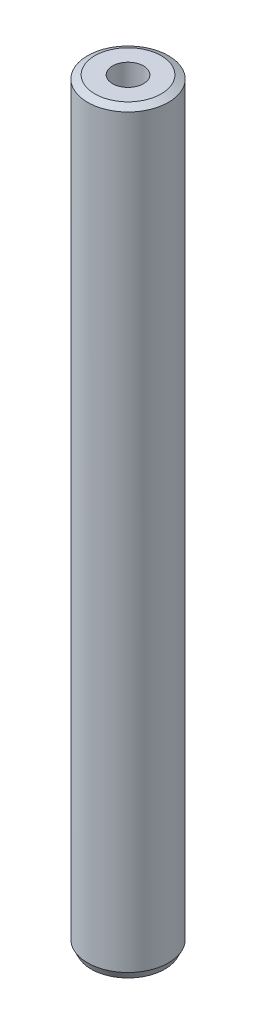
ISO-10303-21;
HEADER;
FILE_DESCRIPTION(('STEP AP214'),'2;1');
FILE_NAME('part.step','',(''),(''),'','','');
FILE_SCHEMA(('AUTOMOTIVE_DESIGN { 1 0 10303 214 1 1 1 1 }'));
ENDSEC;
DATA;
#1=APPLICATION_CONTEXT('core data for automotive mechanical design processes');
#2=APPLICATION_PROTOCOL_DEFINITION('international standard','automotive_design',2000,#1);
#3=PRODUCT_CONTEXT('',#1,'mechanical');
#4=PRODUCT('Part','Part','',(#3));
#5=PRODUCT_RELATED_PRODUCT_CATEGORY('part','',(#4));
#6=PRODUCT_DEFINITION_FORMATION('','',#4);
#7=PRODUCT_DEFINITION_CONTEXT('part definition',#1,'design');
#8=PRODUCT_DEFINITION('design','',#6,#7);
#9=PRODUCT_DEFINITION_SHAPE('','',#8);
#10=(LENGTH_UNIT() NAMED_UNIT(*) SI_UNIT(.MILLI.,.METRE.));
#11=(NAMED_UNIT(*) PLANE_ANGLE_UNIT() SI_UNIT($,.RADIAN.));
#12=(NAMED_UNIT(*) SI_UNIT($,.STERADIAN.) SOLID_ANGLE_UNIT());
#13=UNCERTAINTY_MEASURE_WITH_UNIT(LENGTH_MEASURE(1.E-05),#10,'distance_accuracy_value','');
#14=(GEOMETRIC_REPRESENTATION_CONTEXT(3) GLOBAL_UNCERTAINTY_ASSIGNED_CONTEXT((#13)) GLOBAL_UNIT_ASSIGNED_CONTEXT((#10,
#11,#12)) REPRESENTATION_CONTEXT('',''));
#15=CARTESIAN_POINT('',(0.,0.,0.));
#16=DIRECTION('',(0.,0.,1.));
#17=DIRECTION('',(1.,0.,0.));
#18=AXIS2_PLACEMENT_3D('',#15,#16,#17);
#19=CARTESIAN_POINT('',(0.,420.642684442618,0.));
#20=DIRECTION('',(0.,-1.,0.));
#21=DIRECTION('',(0.,0.,-1.));
#22=AXIS2_PLACEMENT_3D('',#19,#20,#21);
#23=CYLINDRICAL_SURFACE('',#22,22.5);
#24=CARTESIAN_POINT('',(0.,418.624460635499,0.));
#25=DIRECTION('',(0.,1.,0.));
#26=DIRECTION('',(0.,0.,1.));
#27=AXIS2_PLACEMENT_3D('',#24,#25,#26);
#28=CIRCLE('',#27,22.5);
#29=CARTESIAN_POINT('',(0.,418.624460635499,-22.5));
#30=VERTEX_POINT('',#29);
#31=EDGE_CURVE('E50',#30,#30,#28,.F.);
#32=CARTESIAN_POINT('',(0.,4.05966186639178,0.));
#33=DIRECTION('',(0.,1.,0.));
#34=DIRECTION('',(0.,0.,1.));
#35=AXIS2_PLACEMENT_3D('',#32,#33,#34);
#36=CIRCLE('',#35,22.5);
#37=CARTESIAN_POINT('',(0.,4.05966186639178,-22.5));
#38=VERTEX_POINT('',#37);
#39=EDGE_CURVE('E51',#38,#38,#36,.T.);
#40=CARTESIAN_POINT('',(0.,418.624460635499,-22.5));
#41=CARTESIAN_POINT('',(0.,414.306077314988,-22.5));
#42=CARTESIAN_POINT('',(0.,409.987693994476,-22.5));
#43=CARTESIAN_POINT('',(0.,401.350927353453,-22.5));
#44=CARTESIAN_POINT('',(0.,397.032544032942,-22.5));
#45=CARTESIAN_POINT('',(0.,388.395777391919,-22.5));
#46=CARTESIAN_POINT('',(0.,384.077394071407,-22.5));
#47=CARTESIAN_POINT('',(0.,375.440627430384,-22.5));
#48=CARTESIAN_POINT('',(0.,371.122244109873,-22.5));
#49=CARTESIAN_POINT('',(0.,362.485477468849,-22.5));
#50=CARTESIAN_POINT('',(0.,358.167094148338,-22.5));
#51=CARTESIAN_POINT('',(0.,349.530327507315,-22.5));
#52=CARTESIAN_POINT('',(0.,345.211944186803,-22.5));
#53=CARTESIAN_POINT('',(0.,336.57517754578,-22.5));
#54=CARTESIAN_POINT('',(0.,332.256794225269,-22.5));
#55=CARTESIAN_POINT('',(0.,323.620027584246,-22.5));
#56=CARTESIAN_POINT('',(0.,319.301644263734,-22.5));
#57=CARTESIAN_POINT('',(0.,310.664877622711,-22.5));
#58=CARTESIAN_POINT('',(0.,306.346494302199,-22.5));
#59=CARTESIAN_POINT('',(0.,297.709727661176,-22.5));
#60=CARTESIAN_POINT('',(0.,293.391344340665,-22.5));
#61=CARTESIAN_POINT('',(0.,284.754577699642,-22.5));
#62=CARTESIAN_POINT('',(0.,280.43619437913,-22.5));
#63=CARTESIAN_POINT('',(0.,271.799427738107,-22.5));
#64=CARTESIAN_POINT('',(0.,267.481044417596,-22.5));
#65=CARTESIAN_POINT('',(0.,258.844277776573,-22.5));
#66=CARTESIAN_POINT('',(0.,254.525894456061,-22.5));
#67=CARTESIAN_POINT('',(0.,245.889127815038,-22.5));
#68=CARTESIAN_POINT('',(0.,241.570744494526,-22.5));
#69=CARTESIAN_POINT('',(0.,232.933977853503,-22.5));
#70=CARTESIAN_POINT('',(0.,228.615594532992,-22.5));
#71=CARTESIAN_POINT('',(0.,219.978827891969,-22.5));
#72=CARTESIAN_POINT('',(0.,215.660444571457,-22.5));
#73=CARTESIAN_POINT('',(0.,207.023677930434,-22.5));
#74=CARTESIAN_POINT('',(0.,202.705294609923,-22.5));
#75=CARTESIAN_POINT('',(0.,194.068527968899,-22.5));
#76=CARTESIAN_POINT('',(0.,189.750144648388,-22.5));
#77=CARTESIAN_POINT('',(0.,181.113378007365,-22.5));
#78=CARTESIAN_POINT('',(0.,176.794994686853,-22.5));
#79=CARTESIAN_POINT('',(0.,168.15822804583,-22.5));
#80=CARTESIAN_POINT('',(0.,163.839844725319,-22.5));
#81=CARTESIAN_POINT('',(0.,155.203078084296,-22.5));
#82=CARTESIAN_POINT('',(0.,150.884694763784,-22.5));
#83=CARTESIAN_POINT('',(0.,142.247928122761,-22.5));
#84=CARTESIAN_POINT('',(0.,137.929544802249,-22.5));
#85=CARTESIAN_POINT('',(0.,129.292778161226,-22.5));
#86=CARTESIAN_POINT('',(0.,124.974394840715,-22.5));
#87=CARTESIAN_POINT('',(0.,116.337628199692,-22.5));
#88=CARTESIAN_POINT('',(0.,112.01924487918,-22.5));
#89=CARTESIAN_POINT('',(0.,103.382478238157,-22.5));
#90=CARTESIAN_POINT('',(0.,99.0640949176457,-22.5));
#91=CARTESIAN_POINT('',(0.,90.4273282766226,-22.5));
#92=CARTESIAN_POINT('',(0.,86.108944956111,-22.5));
#93=CARTESIAN_POINT('',(0.,77.4721783150879,-22.5));
#94=CARTESIAN_POINT('',(0.,73.1537949945764,-22.5));
#95=CARTESIAN_POINT('',(0.,64.5170283535533,-22.5));
#96=CARTESIAN_POINT('',(0.,60.1986450330418,-22.5));
#97=CARTESIAN_POINT('',(0.,51.5618783920187,-22.5));
#98=CARTESIAN_POINT('',(0.,47.2434950715072,-22.5));
#99=CARTESIAN_POINT('',(0.,38.6067284304841,-22.5));
#100=CARTESIAN_POINT('',(0.,34.2883451099726,-22.5));
#101=CARTESIAN_POINT('',(0.,25.6515784689495,-22.5));
#102=CARTESIAN_POINT('',(0.,21.333195148438,-22.5));
#103=CARTESIAN_POINT('',(0.,12.6964285074149,-22.5));
#104=CARTESIAN_POINT('',(0.,8.37804518690335,-22.5));
#105=CARTESIAN_POINT('',(0.,4.05966186639178,-22.5));
#106=B_SPLINE_CURVE_WITH_KNOTS('',3,(#40,#41,#42,#43,#44,#45,#46,#47,#48,#49,#50,#51,#52,#53,
#54,#55,#56,#57,#58,#59,#60,#61,#62,#63,#64,#65,#66,#67,#68,#69,#70,#71,#72,#73,#74,#75,#76,#77,
#78,#79,#80,#81,#82,#83,#84,#85,#86,#87,#88,#89,#90,#91,#92,#93,#94,#95,#96,#97,#98,#99,#100,
#101,#102,#103,#104,#105),.UNSPECIFIED.,.F.,.F.,(4,2,2,2,2,2,2,2,2,2,2,2,2,2,2,2,2,2,2,2,2,2,2,
2,2,2,2,2,2,2,2,2,4),(0.,12.9551499615346,25.9102999230693,38.8654498846039,51.8205998461385,
64.7757498076731,77.7308997692077,90.6860497307423,103.641199692277,116.596349653812,
129.551499615346,142.506649576881,155.461799538415,168.41694949995,181.372099461485,
194.327249423019,207.282399384554,220.237549346088,233.192699307623,246.147849269158,
259.102999230692,272.058149192227,285.013299153762,297.968449115296,310.923599076831,
323.878749038365,336.8338989999,349.789048961435,362.744198922969,375.699348884504,
388.654498846038,401.609648807573,414.564798769108),.UNSPECIFIED.);
#107=EDGE_CURVE('BSEAM39',#30,#38,#106,.T.);
#108=ORIENTED_EDGE('',*,*,#31,.T.);
#109=ORIENTED_EDGE('',*,*,#39,.T.);
#110=ORIENTED_EDGE('',*,*,#107,.T.);
#111=ORIENTED_EDGE('',*,*,#107,.F.);
#112=EDGE_LOOP('',(#108,#110,#109,#111));
#113=FACE_BOUND('',#112,.T.);
#114=ADVANCED_FACE('F39',(#113),#23,.T.);
#115=CARTESIAN_POINT('',(0.,420.642684442618,0.));
#116=DIRECTION('',(0.,1.,0.));
#117=DIRECTION('',(0.,0.,1.));
#118=AXIS2_PLACEMENT_3D('',#115,#116,#117);
#119=PLANE('',#118);
#120=CARTESIAN_POINT('',(0.,420.642684442618,0.));
#121=DIRECTION('',(0.,1.,0.));
#122=DIRECTION('',(0.,0.,1.));
#123=AXIS2_PLACEMENT_3D('',#120,#121,#122);
#124=CIRCLE('',#123,18.4403381336092);
#125=CARTESIAN_POINT('',(0.,420.642684442618,18.4403381336092));
#126=VERTEX_POINT('',#125);
#127=EDGE_CURVE('E54',#126,#126,#124,.T.);
#128=ORIENTED_EDGE('',*,*,#127,.T.);
#129=EDGE_LOOP('',(#128));
#130=FACE_BOUND('',#129,.T.);
#131=CARTESIAN_POINT('',(0.,420.642684442618,0.));
#132=DIRECTION('',(0.,1.,0.));
#133=DIRECTION('',(0.,0.,1.));
#134=AXIS2_PLACEMENT_3D('',#131,#132,#133);
#135=CIRCLE('',#134,8.60474580931675);
#136=CARTESIAN_POINT('',(0.,420.642684442618,-8.60474580931675));
#137=VERTEX_POINT('',#136);
#138=EDGE_CURVE('E58',#137,#137,#135,.T.);
#139=ORIENTED_EDGE('',*,*,#138,.F.);
#140=EDGE_LOOP('',(#139));
#141=FACE_BOUND('',#140,.T.);
#142=ADVANCED_FACE('F69',(#130,#141),#119,.T.);
#143=CARTESIAN_POINT('',(0.,0.,0.));
#144=DIRECTION('',(0.,1.,0.));
#145=DIRECTION('',(0.,0.,1.));
#146=AXIS2_PLACEMENT_3D('',#143,#144,#145);
#147=PLANE('',#146);
#148=CARTESIAN_POINT('',(0.,0.,0.));
#149=DIRECTION('',(0.,1.,0.));
#150=DIRECTION('',(0.,0.,1.));
#151=AXIS2_PLACEMENT_3D('',#148,#149,#150);
#152=CIRCLE('',#151,20.4817761928807);
#153=CARTESIAN_POINT('',(0.,0.,20.4817761928807));
#154=VERTEX_POINT('',#153);
#155=EDGE_CURVE('E10',#154,#154,#152,.F.);
#156=ORIENTED_EDGE('',*,*,#155,.T.);
#157=EDGE_LOOP('',(#156));
#158=FACE_BOUND('',#157,.T.);
#159=CARTESIAN_POINT('',(0.,0.,0.));
#160=DIRECTION('',(0.,1.,0.));
#161=DIRECTION('',(0.,0.,1.));
#162=AXIS2_PLACEMENT_3D('',#159,#160,#161);
#163=CIRCLE('',#162,8.60474580931675);
#164=CARTESIAN_POINT('',(0.,0.,-8.60474580931675));
#165=VERTEX_POINT('',#164);
#166=EDGE_CURVE('E63',#165,#165,#163,.T.);
#167=ORIENTED_EDGE('',*,*,#166,.T.);
#168=EDGE_LOOP('',(#167));
#169=FACE_BOUND('',#168,.T.);
#170=ADVANCED_FACE('F75',(#158,#169),#147,.F.);
#171=CARTESIAN_POINT('',(0.,420.642684442618,0.));
#172=DIRECTION('',(0.,-1.,0.));
#173=DIRECTION('',(0.,0.,-1.));
#174=AXIS2_PLACEMENT_3D('',#171,#172,#173);
#175=CYLINDRICAL_SURFACE('',#174,8.60474580931675);
#176=CARTESIAN_POINT('',(0.,420.642684442618,-8.60474580931675));
#177=CARTESIAN_POINT('',(0.,416.260989813008,-8.60474580931675));
#178=CARTESIAN_POINT('',(0.,411.879295183397,-8.60474580931675));
#179=CARTESIAN_POINT('',(0.,403.115905924176,-8.60474580931675));
#180=CARTESIAN_POINT('',(0.,398.734211294565,-8.60474580931675));
#181=CARTESIAN_POINT('',(0.,389.970822035344,-8.60474580931675));
#182=CARTESIAN_POINT('',(0.,385.589127405733,-8.60474580931675));
#183=CARTESIAN_POINT('',(0.,376.825738146512,-8.60474580931675));
#184=CARTESIAN_POINT('',(0.,372.444043516902,-8.60474580931675));
#185=CARTESIAN_POINT('',(0.,363.68065425768,-8.60474580931675));
#186=CARTESIAN_POINT('',(0.,359.29895962807,-8.60474580931675));
#187=CARTESIAN_POINT('',(0.,350.535570368848,-8.60474580931675));
#188=CARTESIAN_POINT('',(0.,346.153875739238,-8.60474580931675));
#189=CARTESIAN_POINT('',(0.,337.390486480017,-8.60474580931675));
#190=CARTESIAN_POINT('',(0.,333.008791850406,-8.60474580931675));
#191=CARTESIAN_POINT('',(0.,324.245402591185,-8.60474580931675));
#192=CARTESIAN_POINT('',(0.,319.863707961574,-8.60474580931675));
#193=CARTESIAN_POINT('',(0.,311.100318702353,-8.60474580931675));
#194=CARTESIAN_POINT('',(0.,306.718624072742,-8.60474580931675));
#195=CARTESIAN_POINT('',(0.,297.955234813521,-8.60474580931675));
#196=CARTESIAN_POINT('',(0.,293.573540183911,-8.60474580931675));
#197=CARTESIAN_POINT('',(0.,284.810150924689,-8.60474580931675));
#198=CARTESIAN_POINT('',(0.,280.428456295079,-8.60474580931675));
#199=CARTESIAN_POINT('',(0.,271.665067035858,-8.60474580931675));
#200=CARTESIAN_POINT('',(0.,267.283372406247,-8.60474580931675));
#201=CARTESIAN_POINT('',(0.,258.519983147026,-8.60474580931675));
#202=CARTESIAN_POINT('',(0.,254.138288517415,-8.60474580931675));
#203=CARTESIAN_POINT('',(0.,245.374899258194,-8.60474580931675));
#204=CARTESIAN_POINT('',(0.,240.993204628583,-8.60474580931675));
#205=CARTESIAN_POINT('',(0.,232.229815369362,-8.60474580931675));
#206=CARTESIAN_POINT('',(0.,227.848120739751,-8.60474580931675));
#207=CARTESIAN_POINT('',(0.,219.08473148053,-8.60474580931675));
#208=CARTESIAN_POINT('',(0.,214.70303685092,-8.60474580931675));
#209=CARTESIAN_POINT('',(0.,205.939647591698,-8.60474580931675));
#210=CARTESIAN_POINT('',(0.,201.557952962088,-8.60474580931675));
#211=CARTESIAN_POINT('',(0.,192.794563702867,-8.60474580931675));
#212=CARTESIAN_POINT('',(0.,188.412869073256,-8.60474580931675));
#213=CARTESIAN_POINT('',(0.,179.649479814035,-8.60474580931675));
#214=CARTESIAN_POINT('',(0.,175.267785184424,-8.60474580931675));
#215=CARTESIAN_POINT('',(0.,166.504395925203,-8.60474580931675));
#216=CARTESIAN_POINT('',(0.,162.122701295592,-8.60474580931675));
#217=CARTESIAN_POINT('',(0.,153.359312036371,-8.60474580931675));
#218=CARTESIAN_POINT('',(0.,148.977617406761,-8.60474580931675));
#219=CARTESIAN_POINT('',(0.,140.214228147539,-8.60474580931675));
#220=CARTESIAN_POINT('',(0.,135.832533517929,-8.60474580931675));
#221=CARTESIAN_POINT('',(0.,127.069144258708,-8.60474580931675));
#222=CARTESIAN_POINT('',(0.,122.687449629097,-8.60474580931675));
#223=CARTESIAN_POINT('',(0.,113.924060369876,-8.60474580931675));
#224=CARTESIAN_POINT('',(0.,109.542365740265,-8.60474580931675));
#225=CARTESIAN_POINT('',(0.,100.778976481044,-8.60474580931675));
#226=CARTESIAN_POINT('',(0.,96.3972818514333,-8.60474580931675));
#227=CARTESIAN_POINT('',(0.,87.6338925922121,-8.60474580931675));
#228=CARTESIAN_POINT('',(0.,83.2521979626015,-8.60474580931675));
#229=CARTESIAN_POINT('',(0.,74.4888087033803,-8.60474580931675));
#230=CARTESIAN_POINT('',(0.,70.1071140737697,-8.60474580931675));
#231=CARTESIAN_POINT('',(0.,61.3437248145484,-8.60474580931675));
#232=CARTESIAN_POINT('',(0.,56.9620301849378,-8.60474580931675));
#233=CARTESIAN_POINT('',(0.,48.1986409257166,-8.60474580931675));
#234=CARTESIAN_POINT('',(0.,43.816946296106,-8.60474580931675));
#235=CARTESIAN_POINT('',(0.,35.0535570368848,-8.60474580931675));
#236=CARTESIAN_POINT('',(0.,30.6718624072742,-8.60474580931675));
#237=CARTESIAN_POINT('',(0.,21.908473148053,-8.60474580931675));
#238=CARTESIAN_POINT('',(0.,17.5267785184424,-8.60474580931675));
#239=CARTESIAN_POINT('',(0.,8.76338925922118,-8.60474580931675));
#240=CARTESIAN_POINT('',(0.,4.38169462961056,-8.60474580931675));
#241=CARTESIAN_POINT('',(0.,0.,-8.60474580931675));
#242=B_SPLINE_CURVE_WITH_KNOTS('',3,(#176,#177,#178,#179,#180,#181,#182,#183,#184,#185,#186,
#187,#188,#189,#190,#191,#192,#193,#194,#195,#196,#197,#198,#199,#200,#201,#202,#203,#204,#205,
#206,#207,#208,#209,#210,#211,#212,#213,#214,#215,#216,#217,#218,#219,#220,#221,#222,#223,#224,
#225,#226,#227,#228,#229,#230,#231,#232,#233,#234,#235,#236,#237,#238,#239,#240,#241),
.UNSPECIFIED.,.F.,.F.,(4,2,2,2,2,2,2,2,2,2,2,2,2,2,2,2,2,2,2,2,2,2,2,2,2,2,2,2,2,2,2,2,4),(0.,
13.1450838888318,26.2901677776637,39.4352516664955,52.5803355553273,65.7254194441591,
78.8705033329909,92.0155872218228,105.160671110655,118.305754999486,131.450838888318,
144.59592277715,157.741006665982,170.886090554814,184.031174443646,197.176258332477,
210.321342221309,223.466426110141,236.611509998973,249.756593887805,262.901677776636,
276.046761665468,289.1918455543,302.336929443132,315.482013331964,328.627097220796,
341.772181109627,354.917264998459,368.062348887291,381.207432776123,394.352516664955,
407.497600553786,420.642684442618),.UNSPECIFIED.);
#243=EDGE_CURVE('BSEAM70',#137,#165,#242,.T.);
#244=ORIENTED_EDGE('',*,*,#138,.T.);
#245=ORIENTED_EDGE('',*,*,#166,.F.);
#246=ORIENTED_EDGE('',*,*,#243,.T.);
#247=ORIENTED_EDGE('',*,*,#243,.F.);
#248=EDGE_LOOP('',(#244,#246,#245,#247));
#249=FACE_BOUND('',#248,.T.);
#250=ADVANCED_FACE('F70',(#249),#175,.F.);
#251=CARTESIAN_POINT('',(0.,420.642684442618,0.));
#252=DIRECTION('',(0.,-1.,0.));
#253=DIRECTION('',(0.,0.,-1.));
#254=AXIS2_PLACEMENT_3D('',#251,#252,#253);
#255=CONICAL_SURFACE('',#254,18.4403381336092,1.10943864161297);
#256=ORIENTED_EDGE('',*,*,#31,.F.);
#257=EDGE_LOOP('',(#256));
#258=FACE_BOUND('',#257,.T.);
#259=ORIENTED_EDGE('',*,*,#127,.F.);
#260=EDGE_LOOP('',(#259));
#261=FACE_BOUND('',#260,.T.);
#262=ADVANCED_FACE('F81',(#258,#261),#255,.T.);
#263=CARTESIAN_POINT('',(0.,4.05966186639178,0.));
#264=DIRECTION('',(0.,1.,0.));
#265=DIRECTION('',(0.,0.,1.));
#266=AXIS2_PLACEMENT_3D('',#263,#264,#265);
#267=CONICAL_SURFACE('',#266,22.5,0.461357685181925);
#268=ORIENTED_EDGE('',*,*,#155,.F.);
#269=EDGE_LOOP('',(#268));
#270=FACE_BOUND('',#269,.T.);
#271=ORIENTED_EDGE('',*,*,#39,.F.);
#272=EDGE_LOOP('',(#271));
#273=FACE_BOUND('',#272,.T.);
#274=ADVANCED_FACE('F45',(#270,#273),#267,.T.);
#275=CLOSED_SHELL('',(#114,#142,#170,#250,#262,#274));
#276=MANIFOLD_SOLID_BREP('B2',#275);
#277=ADVANCED_BREP_SHAPE_REPRESENTATION('',(#18,#276),#14);
#278=SHAPE_DEFINITION_REPRESENTATION(#9,#277);
ENDSEC;
END-ISO-10303-21;
